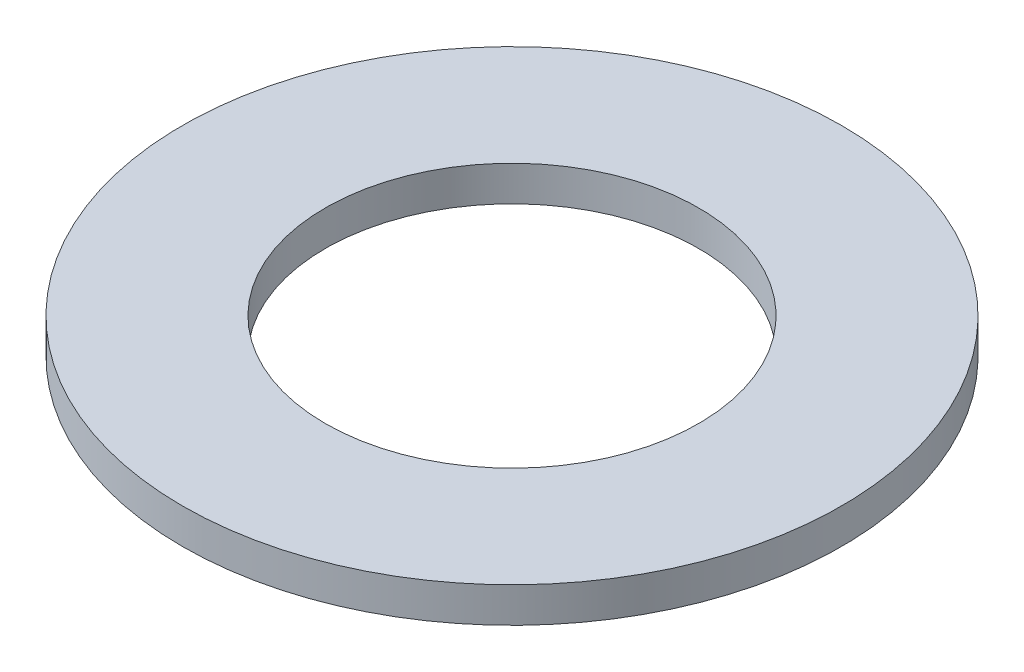
ISO-10303-21;
HEADER;
FILE_DESCRIPTION(('STEP AP214'),'2;1');
FILE_NAME('part.step','',(''),(''),'','','');
FILE_SCHEMA(('AUTOMOTIVE_DESIGN { 1 0 10303 214 1 1 1 1 }'));
ENDSEC;
DATA;
#1=APPLICATION_CONTEXT('core data for automotive mechanical design processes');
#2=APPLICATION_PROTOCOL_DEFINITION('international standard','automotive_design',2000,#1);
#3=PRODUCT_CONTEXT('',#1,'mechanical');
#4=PRODUCT('Part','Part','',(#3));
#5=PRODUCT_RELATED_PRODUCT_CATEGORY('part','',(#4));
#6=PRODUCT_DEFINITION_FORMATION('','',#4);
#7=PRODUCT_DEFINITION_CONTEXT('part definition',#1,'design');
#8=PRODUCT_DEFINITION('design','',#6,#7);
#9=PRODUCT_DEFINITION_SHAPE('','',#8);
#10=(LENGTH_UNIT() NAMED_UNIT(*) SI_UNIT(.MILLI.,.METRE.));
#11=(NAMED_UNIT(*) PLANE_ANGLE_UNIT() SI_UNIT($,.RADIAN.));
#12=(NAMED_UNIT(*) SI_UNIT($,.STERADIAN.) SOLID_ANGLE_UNIT());
#13=UNCERTAINTY_MEASURE_WITH_UNIT(LENGTH_MEASURE(1.E-05),#10,'distance_accuracy_value','');
#14=(GEOMETRIC_REPRESENTATION_CONTEXT(3) GLOBAL_UNCERTAINTY_ASSIGNED_CONTEXT((#13)) GLOBAL_UNIT_ASSIGNED_CONTEXT((#10,
#11,#12)) REPRESENTATION_CONTEXT('',''));
#15=CARTESIAN_POINT('',(0.,0.,0.));
#16=DIRECTION('',(0.,0.,1.));
#17=DIRECTION('',(1.,0.,0.));
#18=AXIS2_PLACEMENT_3D('',#15,#16,#17);
#19=CARTESIAN_POINT('',(0.,8.,0.));
#20=DIRECTION('',(0.,-1.,0.));
#21=DIRECTION('',(0.,0.,-1.));
#22=AXIS2_PLACEMENT_3D('',#19,#20,#21);
#23=CYLINDRICAL_SURFACE('',#22,75.);
#24=CARTESIAN_POINT('',(0.,8.,0.));
#25=DIRECTION('',(0.,1.,0.));
#26=DIRECTION('',(0.,0.,1.));
#27=AXIS2_PLACEMENT_3D('',#24,#25,#26);
#28=CIRCLE('',#27,75.);
#29=CARTESIAN_POINT('',(0.,8.,75.));
#30=VERTEX_POINT('',#29);
#31=EDGE_CURVE('E10',#30,#30,#28,.T.);
#32=ORIENTED_EDGE('',*,*,#31,.F.);
#33=EDGE_LOOP('',(#32));
#34=FACE_BOUND('',#33,.T.);
#35=CARTESIAN_POINT('',(0.,0.,0.));
#36=DIRECTION('',(0.,1.,0.));
#37=DIRECTION('',(0.,0.,1.));
#38=AXIS2_PLACEMENT_3D('',#35,#36,#37);
#39=CIRCLE('',#38,75.);
#40=CARTESIAN_POINT('',(0.,0.,75.));
#41=VERTEX_POINT('',#40);
#42=EDGE_CURVE('E37',#41,#41,#39,.T.);
#43=ORIENTED_EDGE('',*,*,#42,.T.);
#44=EDGE_LOOP('',(#43));
#45=FACE_BOUND('',#44,.T.);
#46=ADVANCED_FACE('F40',(#34,#45),#23,.T.);
#47=CARTESIAN_POINT('',(0.,8.,0.));
#48=DIRECTION('',(0.,1.,0.));
#49=DIRECTION('',(0.,0.,1.));
#50=AXIS2_PLACEMENT_3D('',#47,#48,#49);
#51=PLANE('',#50);
#52=CARTESIAN_POINT('',(0.,8.,0.));
#53=DIRECTION('',(0.,1.,0.));
#54=DIRECTION('',(0.,0.,1.));
#55=AXIS2_PLACEMENT_3D('',#52,#53,#54);
#56=CIRCLE('',#55,42.5);
#57=CARTESIAN_POINT('',(0.,8.,42.5));
#58=VERTEX_POINT('',#57);
#59=EDGE_CURVE('E50',#58,#58,#56,.T.);
#60=ORIENTED_EDGE('',*,*,#59,.F.);
#61=EDGE_LOOP('',(#60));
#62=FACE_BOUND('',#61,.T.);
#63=ORIENTED_EDGE('',*,*,#31,.T.);
#64=EDGE_LOOP('',(#63));
#65=FACE_BOUND('',#64,.T.);
#66=ADVANCED_FACE('F59',(#62,#65),#51,.T.);
#67=CARTESIAN_POINT('',(0.,0.,0.));
#68=DIRECTION('',(0.,1.,0.));
#69=DIRECTION('',(0.,0.,1.));
#70=AXIS2_PLACEMENT_3D('',#67,#68,#69);
#71=PLANE('',#70);
#72=CARTESIAN_POINT('',(0.,0.,0.));
#73=DIRECTION('',(0.,1.,0.));
#74=DIRECTION('',(0.,0.,1.));
#75=AXIS2_PLACEMENT_3D('',#72,#73,#74);
#76=CIRCLE('',#75,42.5);
#77=CARTESIAN_POINT('',(0.,0.,42.5));
#78=VERTEX_POINT('',#77);
#79=EDGE_CURVE('E47',#78,#78,#76,.T.);
#80=ORIENTED_EDGE('',*,*,#79,.T.);
#81=EDGE_LOOP('',(#80));
#82=FACE_BOUND('',#81,.T.);
#83=ORIENTED_EDGE('',*,*,#42,.F.);
#84=EDGE_LOOP('',(#83));
#85=FACE_BOUND('',#84,.T.);
#86=ADVANCED_FACE('F58',(#82,#85),#71,.F.);
#87=CARTESIAN_POINT('',(0.,8.,0.));
#88=DIRECTION('',(0.,-1.,0.));
#89=DIRECTION('',(0.,0.,-1.));
#90=AXIS2_PLACEMENT_3D('',#87,#88,#89);
#91=CYLINDRICAL_SURFACE('',#90,42.5);
#92=ORIENTED_EDGE('',*,*,#59,.T.);
#93=EDGE_LOOP('',(#92));
#94=FACE_BOUND('',#93,.T.);
#95=ORIENTED_EDGE('',*,*,#79,.F.);
#96=EDGE_LOOP('',(#95));
#97=FACE_BOUND('',#96,.T.);
#98=ADVANCED_FACE('F54',(#94,#97),#91,.F.);
#99=CLOSED_SHELL('',(#46,#66,#86,#98));
#100=MANIFOLD_SOLID_BREP('B2',#99);
#101=ADVANCED_BREP_SHAPE_REPRESENTATION('',(#18,#100),#14);
#102=SHAPE_DEFINITION_REPRESENTATION(#9,#101);
ENDSEC;
END-ISO-10303-21;
